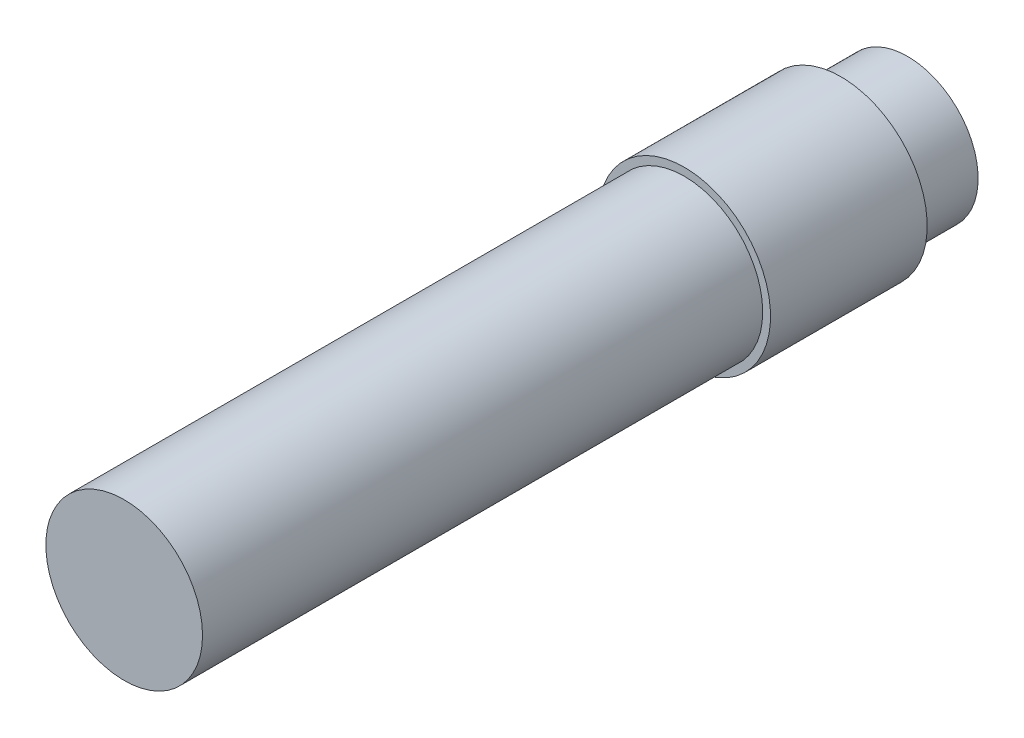
ISO-10303-21;
HEADER;
FILE_DESCRIPTION(('STEP AP214'),'2;1');
FILE_NAME('part.step','',(''),(''),'','','');
FILE_SCHEMA(('AUTOMOTIVE_DESIGN { 1 0 10303 214 1 1 1 1 }'));
ENDSEC;
DATA;
#1=APPLICATION_CONTEXT('core data for automotive mechanical design processes');
#2=APPLICATION_PROTOCOL_DEFINITION('international standard','automotive_design',2000,#1);
#3=PRODUCT_CONTEXT('',#1,'mechanical');
#4=PRODUCT('Part','Part','',(#3));
#5=PRODUCT_RELATED_PRODUCT_CATEGORY('part','',(#4));
#6=PRODUCT_DEFINITION_FORMATION('','',#4);
#7=PRODUCT_DEFINITION_CONTEXT('part definition',#1,'design');
#8=PRODUCT_DEFINITION('design','',#6,#7);
#9=PRODUCT_DEFINITION_SHAPE('','',#8);
#10=(LENGTH_UNIT() NAMED_UNIT(*) SI_UNIT(.MILLI.,.METRE.));
#11=(NAMED_UNIT(*) PLANE_ANGLE_UNIT() SI_UNIT($,.RADIAN.));
#12=(NAMED_UNIT(*) SI_UNIT($,.STERADIAN.) SOLID_ANGLE_UNIT());
#13=UNCERTAINTY_MEASURE_WITH_UNIT(LENGTH_MEASURE(1.E-05),#10,'distance_accuracy_value','');
#14=(GEOMETRIC_REPRESENTATION_CONTEXT(3) GLOBAL_UNCERTAINTY_ASSIGNED_CONTEXT((#13)) GLOBAL_UNIT_ASSIGNED_CONTEXT((#10,
#11,#12)) REPRESENTATION_CONTEXT('',''));
#15=CARTESIAN_POINT('',(0.,0.,0.));
#16=DIRECTION('',(0.,0.,1.));
#17=DIRECTION('',(1.,0.,0.));
#18=AXIS2_PLACEMENT_3D('',#15,#16,#17);
#19=CARTESIAN_POINT('',(0.,0.,100.));
#20=DIRECTION('',(0.,0.,-1.));
#21=DIRECTION('',(-1.,0.,0.));
#22=AXIS2_PLACEMENT_3D('',#19,#20,#21);
#23=CYLINDRICAL_SURFACE('',#22,11.);
#24=CARTESIAN_POINT('',(0.,0.,28.5));
#25=DIRECTION('',(0.,0.,-1.));
#26=DIRECTION('',(-1.,0.,0.));
#27=AXIS2_PLACEMENT_3D('',#24,#25,#26);
#28=CIRCLE('',#27,11.);
#29=CARTESIAN_POINT('',(-11.,0.,28.5));
#30=VERTEX_POINT('',#29);
#31=EDGE_CURVE('E50',#30,#30,#28,.F.);
#32=ORIENTED_EDGE('',*,*,#31,.F.);
#33=EDGE_LOOP('',(#32));
#34=FACE_BOUND('',#33,.T.);
#35=CARTESIAN_POINT('',(0.,0.,8.5));
#36=DIRECTION('',(0.,0.,-1.));
#37=DIRECTION('',(-1.,0.,0.));
#38=AXIS2_PLACEMENT_3D('',#35,#36,#37);
#39=CIRCLE('',#38,11.);
#40=CARTESIAN_POINT('',(-11.,0.,8.5));
#41=VERTEX_POINT('',#40);
#42=EDGE_CURVE('E11',#41,#41,#39,.T.);
#43=ORIENTED_EDGE('',*,*,#42,.F.);
#44=EDGE_LOOP('',(#43));
#45=FACE_BOUND('',#44,.T.);
#46=ADVANCED_FACE('F33',(#34,#45),#23,.T.);
#47=CARTESIAN_POINT('',(0.,0.,8.5));
#48=DIRECTION('',(0.,0.,-1.));
#49=DIRECTION('',(-1.,0.,0.));
#50=AXIS2_PLACEMENT_3D('',#47,#48,#49);
#51=PLANE('',#50);
#52=CARTESIAN_POINT('',(0.,0.,8.5));
#53=DIRECTION('',(0.,0.,-1.));
#54=DIRECTION('',(-1.,0.,0.));
#55=AXIS2_PLACEMENT_3D('',#52,#53,#54);
#56=CIRCLE('',#55,9.);
#57=CARTESIAN_POINT('',(-9.,0.,8.5));
#58=VERTEX_POINT('',#57);
#59=EDGE_CURVE('E39',#58,#58,#56,.T.);
#60=ORIENTED_EDGE('',*,*,#59,.F.);
#61=EDGE_LOOP('',(#60));
#62=FACE_BOUND('',#61,.T.);
#63=ORIENTED_EDGE('',*,*,#42,.T.);
#64=EDGE_LOOP('',(#63));
#65=FACE_BOUND('',#64,.T.);
#66=ADVANCED_FACE('F78',(#62,#65),#51,.T.);
#67=CARTESIAN_POINT('',(0.,0.,8.5));
#68=DIRECTION('',(0.,0.,-1.));
#69=DIRECTION('',(-1.,0.,0.));
#70=AXIS2_PLACEMENT_3D('',#67,#68,#69);
#71=CYLINDRICAL_SURFACE('',#70,9.);
#72=ORIENTED_EDGE('',*,*,#59,.T.);
#73=EDGE_LOOP('',(#72));
#74=FACE_BOUND('',#73,.T.);
#75=CARTESIAN_POINT('',(0.,0.,0.));
#76=DIRECTION('',(0.,0.,-1.));
#77=DIRECTION('',(-1.,0.,0.));
#78=AXIS2_PLACEMENT_3D('',#75,#76,#77);
#79=CIRCLE('',#78,9.);
#80=CARTESIAN_POINT('',(-9.,0.,0.));
#81=VERTEX_POINT('',#80);
#82=EDGE_CURVE('E43',#81,#81,#79,.T.);
#83=ORIENTED_EDGE('',*,*,#82,.F.);
#84=EDGE_LOOP('',(#83));
#85=FACE_BOUND('',#84,.T.);
#86=ADVANCED_FACE('F85',(#74,#85),#71,.T.);
#87=CARTESIAN_POINT('',(0.,0.,0.));
#88=DIRECTION('',(0.,0.,1.));
#89=DIRECTION('',(1.,0.,0.));
#90=AXIS2_PLACEMENT_3D('',#87,#88,#89);
#91=PLANE('',#90);
#92=ORIENTED_EDGE('',*,*,#82,.T.);
#93=EDGE_LOOP('',(#92));
#94=FACE_BOUND('',#93,.T.);
#95=ADVANCED_FACE('F65',(#94),#91,.F.);
#96=CARTESIAN_POINT('',(0.,0.,-22.6126983722081));
#97=DIRECTION('',(0.,0.,1.));
#98=DIRECTION('',(1.,0.,0.));
#99=AXIS2_PLACEMENT_3D('',#96,#97,#98);
#100=CYLINDRICAL_SURFACE('',#99,10.);
#101=CARTESIAN_POINT('',(0.,0.,100.));
#102=DIRECTION('',(0.,0.,1.));
#103=DIRECTION('',(1.,0.,0.));
#104=AXIS2_PLACEMENT_3D('',#101,#102,#103);
#105=CIRCLE('',#104,10.);
#106=CARTESIAN_POINT('',(10.,0.,100.));
#107=VERTEX_POINT('',#106);
#108=EDGE_CURVE('E53',#107,#107,#105,.T.);
#109=ORIENTED_EDGE('',*,*,#108,.F.);
#110=EDGE_LOOP('',(#109));
#111=FACE_BOUND('',#110,.T.);
#112=CARTESIAN_POINT('',(0.,0.,28.5));
#113=DIRECTION('',(0.,0.,-1.));
#114=DIRECTION('',(-1.,0.,0.));
#115=AXIS2_PLACEMENT_3D('',#112,#113,#114);
#116=CIRCLE('',#115,10.);
#117=CARTESIAN_POINT('',(-10.,0.,28.5));
#118=VERTEX_POINT('',#117);
#119=EDGE_CURVE('E48',#118,#118,#116,.F.);
#120=ORIENTED_EDGE('',*,*,#119,.T.);
#121=EDGE_LOOP('',(#120));
#122=FACE_BOUND('',#121,.T.);
#123=ADVANCED_FACE('F61',(#111,#122),#100,.T.);
#124=CARTESIAN_POINT('',(0.,0.,28.5));
#125=DIRECTION('',(0.,0.,-1.));
#126=DIRECTION('',(-1.,0.,0.));
#127=AXIS2_PLACEMENT_3D('',#124,#125,#126);
#128=PLANE('',#127);
#129=ORIENTED_EDGE('',*,*,#31,.T.);
#130=EDGE_LOOP('',(#129));
#131=FACE_BOUND('',#130,.T.);
#132=ORIENTED_EDGE('',*,*,#119,.F.);
#133=EDGE_LOOP('',(#132));
#134=FACE_BOUND('',#133,.T.);
#135=ADVANCED_FACE('F64',(#131,#134),#128,.F.);
#136=CARTESIAN_POINT('',(0.,0.,100.));
#137=DIRECTION('',(0.,0.,1.));
#138=DIRECTION('',(1.,0.,0.));
#139=AXIS2_PLACEMENT_3D('',#136,#137,#138);
#140=PLANE('',#139);
#141=ORIENTED_EDGE('',*,*,#108,.T.);
#142=EDGE_LOOP('',(#141));
#143=FACE_BOUND('',#142,.T.);
#144=ADVANCED_FACE('F59',(#143),#140,.T.);
#145=CLOSED_SHELL('',(#46,#66,#86,#95,#123,#135,#144));
#146=MANIFOLD_SOLID_BREP('B2',#145);
#147=ADVANCED_BREP_SHAPE_REPRESENTATION('',(#18,#146),#14);
#148=SHAPE_DEFINITION_REPRESENTATION(#9,#147);
ENDSEC;
END-ISO-10303-21;
